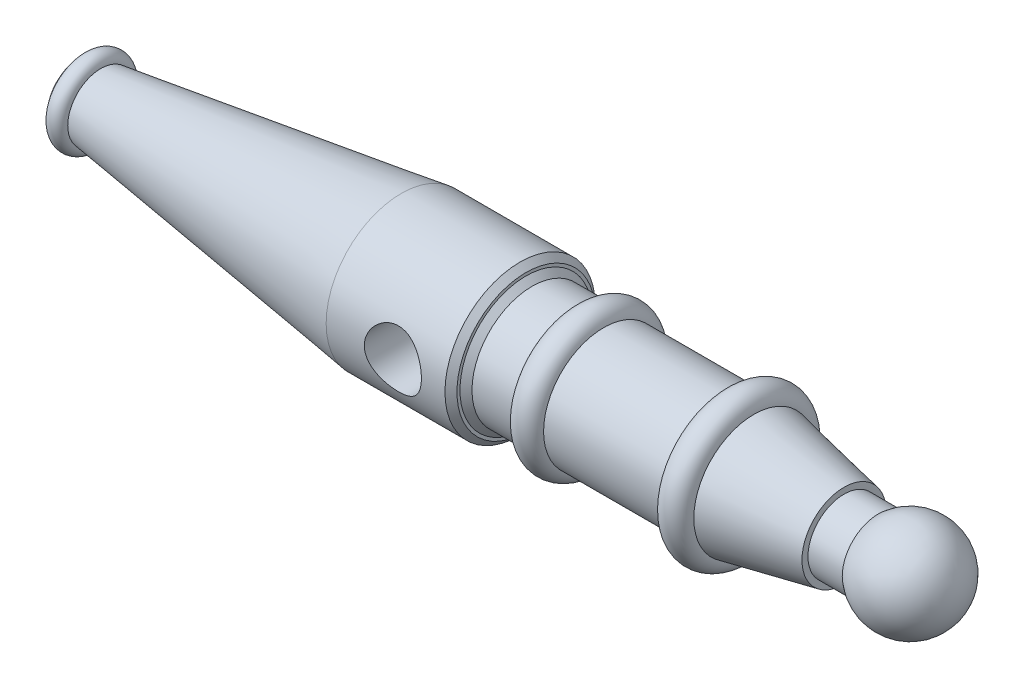
ISO-10303-21;
HEADER;
FILE_DESCRIPTION(('STEP AP214'),'2;1');
FILE_NAME('part.step','',(''),(''),'','','');
FILE_SCHEMA(('AUTOMOTIVE_DESIGN { 1 0 10303 214 1 1 1 1 }'));
ENDSEC;
DATA;
#1=APPLICATION_CONTEXT('core data for automotive mechanical design processes');
#2=APPLICATION_PROTOCOL_DEFINITION('international standard','automotive_design',2000,#1);
#3=PRODUCT_CONTEXT('',#1,'mechanical');
#4=PRODUCT('Part','Part','',(#3));
#5=PRODUCT_RELATED_PRODUCT_CATEGORY('part','',(#4));
#6=PRODUCT_DEFINITION_FORMATION('','',#4);
#7=PRODUCT_DEFINITION_CONTEXT('part definition',#1,'design');
#8=PRODUCT_DEFINITION('design','',#6,#7);
#9=PRODUCT_DEFINITION_SHAPE('','',#8);
#10=(LENGTH_UNIT() NAMED_UNIT(*) SI_UNIT(.MILLI.,.METRE.));
#11=(NAMED_UNIT(*) PLANE_ANGLE_UNIT() SI_UNIT($,.RADIAN.));
#12=(NAMED_UNIT(*) SI_UNIT($,.STERADIAN.) SOLID_ANGLE_UNIT());
#13=UNCERTAINTY_MEASURE_WITH_UNIT(LENGTH_MEASURE(1.E-05),#10,'distance_accuracy_value','');
#14=(GEOMETRIC_REPRESENTATION_CONTEXT(3) GLOBAL_UNCERTAINTY_ASSIGNED_CONTEXT((#13)) GLOBAL_UNIT_ASSIGNED_CONTEXT((#10,
#11,#12)) REPRESENTATION_CONTEXT('',''));
#15=CARTESIAN_POINT('',(0.,0.,0.));
#16=DIRECTION('',(0.,0.,1.));
#17=DIRECTION('',(1.,0.,0.));
#18=AXIS2_PLACEMENT_3D('',#15,#16,#17);
#19=CARTESIAN_POINT('',(19.,0.,0.));
#20=DIRECTION('',(-1.,0.,0.));
#21=DIRECTION('',(0.,0.,1.));
#22=AXIS2_PLACEMENT_3D('',#19,#20,#21);
#23=TOROIDAL_SURFACE('',#22,54.9999999999999,15.);
#24=CARTESIAN_POINT('',(34.,0.,0.));
#25=DIRECTION('',(-1.,0.,0.));
#26=DIRECTION('',(0.,0.,1.));
#27=AXIS2_PLACEMENT_3D('',#24,#25,#26);
#28=CIRCLE('',#27,54.9999999999998);
#29=CARTESIAN_POINT('',(34.,0.,54.9999999999998));
#30=VERTEX_POINT('',#29);
#31=EDGE_CURVE('E207',#30,#30,#28,.T.);
#32=ORIENTED_EDGE('',*,*,#31,.T.);
#33=EDGE_LOOP('',(#32));
#34=FACE_BOUND('',#33,.T.);
#35=CARTESIAN_POINT('',(4.,0.,0.));
#36=DIRECTION('',(-1.,0.,0.));
#37=DIRECTION('',(0.,0.,1.));
#38=AXIS2_PLACEMENT_3D('',#35,#36,#37);
#39=CIRCLE('',#38,55.);
#40=CARTESIAN_POINT('',(4.,0.,55.));
#41=VERTEX_POINT('',#40);
#42=EDGE_CURVE('E165',#41,#41,#39,.T.);
#43=ORIENTED_EDGE('',*,*,#42,.F.);
#44=EDGE_LOOP('',(#43));
#45=FACE_BOUND('',#44,.T.);
#46=ADVANCED_FACE('F42',(#34,#45),#23,.T.);
#47=CARTESIAN_POINT('',(0.,0.,0.));
#48=DIRECTION('',(-1.,0.,0.));
#49=DIRECTION('',(0.,0.,1.));
#50=AXIS2_PLACEMENT_3D('',#47,#48,#49);
#51=CYLINDRICAL_SURFACE('',#50,55.);
#52=ORIENTED_EDGE('',*,*,#42,.T.);
#53=EDGE_LOOP('',(#52));
#54=FACE_BOUND('',#53,.T.);
#55=CARTESIAN_POINT('',(0.,0.,0.));
#56=DIRECTION('',(-1.,0.,0.));
#57=DIRECTION('',(0.,0.,1.));
#58=AXIS2_PLACEMENT_3D('',#55,#56,#57);
#59=CIRCLE('',#58,55.);
#60=CARTESIAN_POINT('',(0.,0.,55.));
#61=VERTEX_POINT('',#60);
#62=EDGE_CURVE('E171',#61,#61,#59,.T.);
#63=ORIENTED_EDGE('',*,*,#62,.F.);
#64=EDGE_LOOP('',(#63));
#65=FACE_BOUND('',#64,.T.);
#66=ADVANCED_FACE('F97',(#54,#65),#51,.T.);
#67=CARTESIAN_POINT('',(0.,0.,0.));
#68=DIRECTION('',(1.,0.,0.));
#69=DIRECTION('',(0.,0.,-1.));
#70=AXIS2_PLACEMENT_3D('',#67,#68,#69);
#71=PLANE('',#70);
#72=CARTESIAN_POINT('',(0.,0.,0.));
#73=DIRECTION('',(-1.,0.,0.));
#74=DIRECTION('',(0.,0.,1.));
#75=AXIS2_PLACEMENT_3D('',#72,#73,#74);
#76=CIRCLE('',#75,47.5);
#77=CARTESIAN_POINT('',(0.,0.,47.5));
#78=VERTEX_POINT('',#77);
#79=EDGE_CURVE('E210',#78,#78,#76,.T.);
#80=ORIENTED_EDGE('',*,*,#79,.F.);
#81=EDGE_LOOP('',(#80));
#82=FACE_BOUND('',#81,.T.);
#83=ORIENTED_EDGE('',*,*,#62,.T.);
#84=EDGE_LOOP('',(#83));
#85=FACE_BOUND('',#84,.T.);
#86=ADVANCED_FACE('F103',(#82,#85),#71,.F.);
#87=CARTESIAN_POINT('',(1380.76376416123,0.,0.));
#88=DIRECTION('',(-1.,0.,0.));
#89=DIRECTION('',(0.,1.,0.));
#90=AXIS2_PLACEMENT_3D('',#87,#88,#89);
#91=SPHERICAL_SURFACE('',#90,80.);
#92=CARTESIAN_POINT('',(1327.84873793994,0.,0.));
#93=DIRECTION('',(-1.,0.,0.));
#94=DIRECTION('',(0.,0.,1.));
#95=AXIS2_PLACEMENT_3D('',#92,#93,#94);
#96=CIRCLE('',#95,60.);
#97=CARTESIAN_POINT('',(1327.84873793994,0.,60.));
#98=VERTEX_POINT('',#97);
#99=EDGE_CURVE('E175',#98,#98,#96,.T.);
#100=ORIENTED_EDGE('',*,*,#99,.F.);
#101=EDGE_LOOP('',(#100));
#102=FACE_BOUND('',#101,.T.);
#103=ADVANCED_FACE('F116',(#102),#91,.T.);
#104=CARTESIAN_POINT('',(0.,0.,0.));
#105=DIRECTION('',(-1.,0.,0.));
#106=DIRECTION('',(0.,0.,1.));
#107=AXIS2_PLACEMENT_3D('',#104,#105,#106);
#108=CYLINDRICAL_SURFACE('',#107,60.);
#109=ORIENTED_EDGE('',*,*,#99,.T.);
#110=EDGE_LOOP('',(#109));
#111=FACE_BOUND('',#110,.T.);
#112=CARTESIAN_POINT('',(1270.84873793994,0.,0.));
#113=DIRECTION('',(-1.,0.,0.));
#114=DIRECTION('',(0.,0.,1.));
#115=AXIS2_PLACEMENT_3D('',#112,#113,#114);
#116=CIRCLE('',#115,60.);
#117=CARTESIAN_POINT('',(1270.84873793994,0.,60.));
#118=VERTEX_POINT('',#117);
#119=EDGE_CURVE('E179',#118,#118,#116,.T.);
#120=ORIENTED_EDGE('',*,*,#119,.F.);
#121=EDGE_LOOP('',(#120));
#122=FACE_BOUND('',#121,.T.);
#123=ADVANCED_FACE('F120',(#111,#122),#108,.T.);
#124=CARTESIAN_POINT('',(1270.84873793994,0.,0.));
#125=DIRECTION('',(-1.,0.,0.));
#126=DIRECTION('',(0.,0.,1.));
#127=AXIS2_PLACEMENT_3D('',#124,#125,#126);
#128=PLANE('',#127);
#129=CARTESIAN_POINT('',(1270.84873793994,0.,0.));
#130=DIRECTION('',(-1.,0.,0.));
#131=DIRECTION('',(0.,0.,1.));
#132=AXIS2_PLACEMENT_3D('',#129,#130,#131);
#133=CIRCLE('',#132,70.);
#134=CARTESIAN_POINT('',(1270.84873793994,0.,70.));
#135=VERTEX_POINT('',#134);
#136=EDGE_CURVE('E183',#135,#135,#133,.T.);
#137=ORIENTED_EDGE('',*,*,#136,.F.);
#138=EDGE_LOOP('',(#137));
#139=FACE_BOUND('',#138,.T.);
#140=ORIENTED_EDGE('',*,*,#119,.T.);
#141=EDGE_LOOP('',(#140));
#142=FACE_BOUND('',#141,.T.);
#143=ADVANCED_FACE('F124',(#139,#142),#128,.F.);
#144=CARTESIAN_POINT('',(1270.84873793994,0.,0.));
#145=DIRECTION('',(-1.,0.,0.));
#146=DIRECTION('',(0.,0.,1.));
#147=AXIS2_PLACEMENT_3D('',#144,#145,#146);
#148=CONICAL_SURFACE('',#147,70.,0.197395559849881);
#149=CARTESIAN_POINT('',(1120.84873793994,0.,0.));
#150=DIRECTION('',(-1.,0.,0.));
#151=DIRECTION('',(0.,0.,1.));
#152=AXIS2_PLACEMENT_3D('',#149,#150,#151);
#153=CIRCLE('',#152,100.);
#154=CARTESIAN_POINT('',(1120.84873793994,0.,100.));
#155=VERTEX_POINT('',#154);
#156=EDGE_CURVE('E187',#155,#155,#153,.T.);
#157=ORIENTED_EDGE('',*,*,#156,.F.);
#158=EDGE_LOOP('',(#157));
#159=FACE_BOUND('',#158,.T.);
#160=ORIENTED_EDGE('',*,*,#136,.T.);
#161=EDGE_LOOP('',(#160));
#162=FACE_BOUND('',#161,.T.);
#163=ADVANCED_FACE('F128',(#159,#162),#148,.T.);
#164=CARTESIAN_POINT('',(1095.84873793994,0.,0.));
#165=DIRECTION('',(-1.,0.,0.));
#166=DIRECTION('',(0.,0.,1.));
#167=AXIS2_PLACEMENT_3D('',#164,#165,#166);
#168=TOROIDAL_SURFACE('',#167,100.,24.9999999999998);
#169=CARTESIAN_POINT('',(1070.84873793994,0.,0.));
#170=DIRECTION('',(-1.,0.,0.));
#171=DIRECTION('',(0.,0.,1.));
#172=AXIS2_PLACEMENT_3D('',#169,#170,#171);
#173=CIRCLE('',#172,100.);
#174=CARTESIAN_POINT('',(1070.84873793994,0.,100.));
#175=VERTEX_POINT('',#174);
#176=EDGE_CURVE('E191',#175,#175,#173,.T.);
#177=ORIENTED_EDGE('',*,*,#176,.F.);
#178=EDGE_LOOP('',(#177));
#179=FACE_BOUND('',#178,.T.);
#180=ORIENTED_EDGE('',*,*,#156,.T.);
#181=EDGE_LOOP('',(#180));
#182=FACE_BOUND('',#181,.T.);
#183=ADVANCED_FACE('F132',(#179,#182),#168,.T.);
#184=CARTESIAN_POINT('',(0.,0.,0.));
#185=DIRECTION('',(-1.,0.,0.));
#186=DIRECTION('',(0.,0.,1.));
#187=AXIS2_PLACEMENT_3D('',#184,#185,#186);
#188=CYLINDRICAL_SURFACE('',#187,100.);
#189=CARTESIAN_POINT('',(870.848737939936,0.,0.));
#190=DIRECTION('',(-1.,0.,0.));
#191=DIRECTION('',(0.,0.,1.));
#192=AXIS2_PLACEMENT_3D('',#189,#190,#191);
#193=CIRCLE('',#192,100.);
#194=CARTESIAN_POINT('',(870.848737939936,0.,100.));
#195=VERTEX_POINT('',#194);
#196=EDGE_CURVE('E195',#195,#195,#193,.T.);
#197=ORIENTED_EDGE('',*,*,#196,.F.);
#198=EDGE_LOOP('',(#197));
#199=FACE_BOUND('',#198,.T.);
#200=ORIENTED_EDGE('',*,*,#176,.T.);
#201=EDGE_LOOP('',(#200));
#202=FACE_BOUND('',#201,.T.);
#203=ADVANCED_FACE('F136',(#199,#202),#188,.T.);
#204=CARTESIAN_POINT('',(846.281702676516,0.,0.));
#205=DIRECTION('',(-1.,0.,0.));
#206=DIRECTION('',(0.,0.,1.));
#207=AXIS2_PLACEMENT_3D('',#204,#205,#206);
#208=TOROIDAL_SURFACE('',#207,95.3674220604617,25.);
#209=CARTESIAN_POINT('',(821.714667413097,0.,0.));
#210=DIRECTION('',(-1.,0.,0.));
#211=DIRECTION('',(0.,0.,1.));
#212=AXIS2_PLACEMENT_3D('',#209,#210,#211);
#213=CIRCLE('',#212,100.);
#214=CARTESIAN_POINT('',(821.714667413097,0.,100.));
#215=VERTEX_POINT('',#214);
#216=EDGE_CURVE('E199',#215,#215,#213,.T.);
#217=ORIENTED_EDGE('',*,*,#216,.F.);
#218=EDGE_LOOP('',(#217));
#219=FACE_BOUND('',#218,.T.);
#220=ORIENTED_EDGE('',*,*,#196,.T.);
#221=EDGE_LOOP('',(#220));
#222=FACE_BOUND('',#221,.T.);
#223=ADVANCED_FACE('F140',(#219,#222),#208,.T.);
#224=CARTESIAN_POINT('',(0.,0.,0.));
#225=DIRECTION('',(-1.,0.,0.));
#226=DIRECTION('',(0.,0.,1.));
#227=AXIS2_PLACEMENT_3D('',#224,#225,#226);
#228=CYLINDRICAL_SURFACE('',#227,100.);
#229=CARTESIAN_POINT('',(751.714667413097,0.,0.));
#230=DIRECTION('',(1.,0.,0.));
#231=DIRECTION('',(0.,0.,-1.));
#232=AXIS2_PLACEMENT_3D('',#229,#230,#231);
#233=CIRCLE('',#232,100.);
#234=CARTESIAN_POINT('',(751.714667413097,0.,-100.));
#235=VERTEX_POINT('',#234);
#236=EDGE_CURVE('E61',#235,#235,#233,.T.);
#237=ORIENTED_EDGE('',*,*,#236,.T.);
#238=EDGE_LOOP('',(#237));
#239=FACE_BOUND('',#238,.T.);
#240=ORIENTED_EDGE('',*,*,#216,.T.);
#241=EDGE_LOOP('',(#240));
#242=FACE_BOUND('',#241,.T.);
#243=ADVANCED_FACE('F144',(#239,#242),#228,.T.);
#244=CARTESIAN_POINT('',(741.714667413097,0.,0.));
#245=DIRECTION('',(1.,0.,0.));
#246=DIRECTION('',(0.,0.,-1.));
#247=AXIS2_PLACEMENT_3D('',#244,#245,#246);
#248=PLANE('',#247);
#249=CARTESIAN_POINT('',(741.714667413097,0.,0.));
#250=DIRECTION('',(1.,0.,0.));
#251=DIRECTION('',(0.,0.,-1.));
#252=AXIS2_PLACEMENT_3D('',#249,#250,#251);
#253=CIRCLE('',#252,115.);
#254=CARTESIAN_POINT('',(741.714667413097,0.,-115.));
#255=VERTEX_POINT('',#254);
#256=EDGE_CURVE('E66',#255,#255,#253,.T.);
#257=ORIENTED_EDGE('',*,*,#256,.T.);
#258=EDGE_LOOP('',(#257));
#259=FACE_BOUND('',#258,.T.);
#260=CARTESIAN_POINT('',(741.714667413097,0.,0.));
#261=DIRECTION('',(1.,0.,0.));
#262=DIRECTION('',(0.,0.,-1.));
#263=AXIS2_PLACEMENT_3D('',#260,#261,#262);
#264=CIRCLE('',#263,110.000000000001);
#265=CARTESIAN_POINT('',(741.714667413097,0.,-110.000000000001));
#266=VERTEX_POINT('',#265);
#267=EDGE_CURVE('E157',#266,#266,#264,.F.);
#268=ORIENTED_EDGE('',*,*,#267,.T.);
#269=EDGE_LOOP('',(#268));
#270=FACE_BOUND('',#269,.T.);
#271=ADVANCED_FACE('F93',(#259,#270),#248,.T.);
#272=CARTESIAN_POINT('',(0.,0.,0.));
#273=DIRECTION('',(-1.,0.,0.));
#274=DIRECTION('',(0.,0.,1.));
#275=AXIS2_PLACEMENT_3D('',#272,#273,#274);
#276=CYLINDRICAL_SURFACE('',#275,124.999999999999);
#277=CARTESIAN_POINT('',(692.5,0.,-124.999999999999));
#278=CARTESIAN_POINT('',(692.50000676516,1.2849271674247,-125.000005018426));
#279=CARTESIAN_POINT('',(692.447822691497,2.56976198111384,-124.980145337505));
#280=CARTESIAN_POINT('',(692.239654632818,5.12969501400117,-124.901263258785));
#281=CARTESIAN_POINT('',(692.08368048332,6.40479414420784,-124.842244571836));
#282=CARTESIAN_POINT('',(691.669556549392,8.93569300325948,-124.686650456919));
#283=CARTESIAN_POINT('',(691.411424610546,10.1914960630861,-124.590081588513));
#284=CARTESIAN_POINT('',(690.795491950269,12.675172656922,-124.36195287126));
#285=CARTESIAN_POINT('',(690.437688333565,13.903045378487,-124.230392005968));
#286=CARTESIAN_POINT('',(689.626519387184,16.3200996223809,-123.936006830322));
#287=CARTESIAN_POINT('',(689.173348650251,17.5093543248301,-123.773246241103));
#288=CARTESIAN_POINT('',(688.174843198296,19.8442717480155,-123.420415933334));
#289=CARTESIAN_POINT('',(687.629509248233,20.9899348304681,-123.230346441452));
#290=CARTESIAN_POINT('',(686.450804859467,23.2311097043018,-122.827571985207));
#291=CARTESIAN_POINT('',(685.817415643136,24.3266107322994,-122.614862195116));
#292=CARTESIAN_POINT('',(684.467023460525,26.4612700837835,-122.171965804673));
#293=CARTESIAN_POINT('',(683.750017858507,27.5004266296773,-121.941778653483));
#294=CARTESIAN_POINT('',(682.600684812765,29.0321832433588,-121.582984872137));
#295=CARTESIAN_POINT('',(682.197030800232,29.5475736866143,-121.45869046257));
#296=CARTESIAN_POINT('',(681.369079841315,30.5608896533286,-121.207690882118));
#297=CARTESIAN_POINT('',(680.944784056161,31.0588161565374,-121.080985847089));
#298=CARTESIAN_POINT('',(680.076239460578,32.0364627368623,-120.825991690483));
#299=CARTESIAN_POINT('',(679.63199207287,32.5161841076751,-120.697702682329));
#300=CARTESIAN_POINT('',(678.72410491077,33.4568710377908,-120.440340759223));
#301=CARTESIAN_POINT('',(678.260460516756,33.9178320769395,-120.311267663862));
#302=CARTESIAN_POINT('',(676.841419214522,35.2715616891124,-119.924132914316));
#303=CARTESIAN_POINT('',(675.857900287768,36.1351923969078,-119.666151675129));
#304=CARTESIAN_POINT('',(673.821805533593,37.7791682718835,-119.15735488785));
#305=CARTESIAN_POINT('',(672.7692298913,38.5595136623206,-118.906539320551));
#306=CARTESIAN_POINT('',(671.121814515758,39.6782688638012,-118.536059921928));
#307=CARTESIAN_POINT('',(670.549831874832,40.0489845490804,-118.411242450313));
#308=CARTESIAN_POINT('',(669.389809228658,40.7658176007834,-118.166372199717));
#309=CARTESIAN_POINT('',(668.801773051613,41.1119407619481,-118.046318301257));
#310=CARTESIAN_POINT('',(667.610382930647,41.7790224190779,-117.81187685623));
#311=CARTESIAN_POINT('',(667.007027024307,42.0999776693477,-117.697490041197));
#312=CARTESIAN_POINT('',(665.786062294117,42.7160084807204,-117.47531555797));
#313=CARTESIAN_POINT('',(665.168452602026,43.0110824600339,-117.367528293242));
#314=CARTESIAN_POINT('',(663.296224521746,43.8562632384637,-117.055497433889));
#315=CARTESIAN_POINT('',(662.021500556523,44.3667247685352,-116.862444057089));
#316=CARTESIAN_POINT('',(659.428321977462,45.2765051071035,-116.512985964022));
#317=CARTESIAN_POINT('',(658.10987001219,45.6758306332991,-116.356579032725));
#318=CARTESIAN_POINT('',(655.495044738942,46.3448808978937,-116.091670866419));
#319=CARTESIAN_POINT('',(654.200058414119,46.6193320111835,-115.981437999672));
#320=CARTESIAN_POINT('',(651.588829665791,47.0594329956567,-115.803567958241));
#321=CARTESIAN_POINT('',(650.272587802047,47.2250857272533,-115.735929663707));
#322=CARTESIAN_POINT('',(647.629797864523,47.4456716428059,-115.645676560576));
#323=CARTESIAN_POINT('',(646.303253761316,47.5006455455632,-115.623045193944));
#324=CARTESIAN_POINT('',(643.650257922267,47.4993430799609,-115.623581076582));
#325=CARTESIAN_POINT('',(642.323806184856,47.4430711901906,-115.646746482143));
#326=CARTESIAN_POINT('',(639.76356307951,47.2268656895172,-115.73519568773));
#327=CARTESIAN_POINT('',(638.529112272486,47.0735547380743,-115.797787507411));
#328=CARTESIAN_POINT('',(636.078504880489,46.6711760487632,-115.960546646452));
#329=CARTESIAN_POINT('',(634.862347430711,46.4221128523854,-116.0607121837));
#330=CARTESIAN_POINT('',(632.456275214542,45.8305571432365,-116.295576473683));
#331=CARTESIAN_POINT('',(631.266363322182,45.4880544526927,-116.430278988217));
#332=CARTESIAN_POINT('',(628.920375446783,44.7126631430792,-116.730246284058));
#333=CARTESIAN_POINT('',(627.764300595583,44.2797715044572,-116.895512086348));
#334=CARTESIAN_POINT('',(625.47079898711,43.3178462774495,-117.2554166901));
#335=CARTESIAN_POINT('',(624.334155431206,42.7871276287037,-117.450558157761));
#336=CARTESIAN_POINT('',(622.665916885136,41.9264903414215,-117.759339915788));
#337=CARTESIAN_POINT('',(622.11593275234,41.6288353793677,-117.864950932365));
#338=CARTESIAN_POINT('',(621.028707812863,41.0124091189826,-118.080857904717));
#339=CARTESIAN_POINT('',(620.491469682207,40.6936334387113,-118.19115483097));
#340=CARTESIAN_POINT('',(618.899998485348,39.7064033697926,-118.527993127994));
#341=CARTESIAN_POINT('',(617.86599132771,39.0070370266403,-118.760485252721));
#342=CARTESIAN_POINT('',(615.857628994384,37.5303335210958,-119.235377967013));
#343=CARTESIAN_POINT('',(614.883276592296,36.7529927377712,-119.477779016414));
#344=CARTESIAN_POINT('',(613.437683688311,35.5037111963704,-119.85279769498));
#345=CARTESIAN_POINT('',(612.943263894542,35.057931498026,-119.984026085245));
#346=CARTESIAN_POINT('',(611.973737644043,34.1461385504411,-120.246689454446));
#347=CARTESIAN_POINT('',(611.498626827612,33.6801299183125,-120.378124379711));
#348=CARTESIAN_POINT('',(610.103056953906,32.2525069261578,-120.77147728379));
#349=CARTESIAN_POINT('',(609.212305340598,31.2612478153622,-121.032457847301));
#350=CARTESIAN_POINT('',(607.516073952146,29.2058473618003,-121.544809020291));
#351=CARTESIAN_POINT('',(606.710608728384,28.1416936327567,-121.7961779852));
#352=CARTESIAN_POINT('',(605.190497372134,25.9467780750064,-122.282574118138));
#353=CARTESIAN_POINT('',(604.475850693068,24.8160166472286,-122.517601384514));
#354=CARTESIAN_POINT('',(603.131896189838,22.4758124854458,-122.968616684437));
#355=CARTESIAN_POINT('',(602.504173854403,21.2653859134339,-123.184230805613));
#356=CARTESIAN_POINT('',(601.353536718459,18.7908991395602,-123.585893050066));
#357=CARTESIAN_POINT('',(600.830623923062,17.5268379121741,-123.771940607692));
#358=CARTESIAN_POINT('',(599.894764903049,14.9545998648748,-124.108990890306));
#359=CARTESIAN_POINT('',(599.48177806092,13.6464395413847,-124.26000655688));
#360=CARTESIAN_POINT('',(598.769814623,10.9955927409216,-124.522569692076));
#361=CARTESIAN_POINT('',(598.470830996985,9.65290839838955,-124.634119594397));
#362=CARTESIAN_POINT('',(598.003236646832,7.01759107866686,-124.809460917357));
#363=CARTESIAN_POINT('',(597.828419910445,5.72620734774753,-124.875519746648));
#364=CARTESIAN_POINT('',(597.585473235344,3.13203120051061,-124.967494183786));
#365=CARTESIAN_POINT('',(597.517339427529,1.82923919966333,-124.993411247466));
#366=CARTESIAN_POINT('',(597.488483318778,-0.777436967492819,-125.004376166944));
#367=CARTESIAN_POINT('',(597.527739475051,-2.08132086230679,-124.989432219599));
#368=CARTESIAN_POINT('',(597.713198201032,-4.68034368826085,-124.919110836671));
#369=CARTESIAN_POINT('',(597.85939906446,-5.97548275858993,-124.863734046184));
#370=CARTESIAN_POINT('',(598.249286070419,-8.49599436937247,-124.717072380084));
#371=CARTESIAN_POINT('',(598.48886591097,-9.72209365092606,-124.627302444089));
#372=CARTESIAN_POINT('',(599.062968714554,-12.1488166843962,-124.414186631736));
#373=CARTESIAN_POINT('',(599.397488508601,-13.3494412851912,-124.290841876073));
#374=CARTESIAN_POINT('',(600.158566968472,-15.7176001750415,-124.013622645739));
#375=CARTESIAN_POINT('',(600.585133170823,-16.8851317456629,-123.859745671252));
#376=CARTESIAN_POINT('',(601.526810991555,-19.1799433421884,-123.52519800747));
#377=CARTESIAN_POINT('',(602.041925542823,-20.3072220333483,-123.344526430716));
#378=CARTESIAN_POINT('',(603.173362113986,-22.5478114705223,-122.954980691788));
#379=CARTESIAN_POINT('',(603.79223134561,-23.6597178981112,-122.745429338789));
#380=CARTESIAN_POINT('',(605.115241905845,-25.8276755020338,-122.307621844967));
#381=CARTESIAN_POINT('',(605.819384412791,-26.8837259062404,-122.079365445684));
#382=CARTESIAN_POINT('',(607.308527049079,-28.9345686216089,-121.609612549462));
#383=CARTESIAN_POINT('',(608.093552809141,-29.9293413542206,-121.368111867012));
#384=CARTESIAN_POINT('',(609.739535354384,-31.852021822686,-120.877761501386));
#385=CARTESIAN_POINT('',(610.600494865206,-32.7799271561604,-120.628911554621));
#386=CARTESIAN_POINT('',(612.447023691486,-34.617186330973,-120.115002492798));
#387=CARTESIAN_POINT('',(613.436962662356,-35.522131502835,-119.849861988682));
#388=CARTESIAN_POINT('',(615.490748936808,-37.2458256589097,-119.325438597588));
#389=CARTESIAN_POINT('',(616.554599327037,-38.0645710396986,-119.066155955842));
#390=CARTESIAN_POINT('',(618.750071711411,-39.6105278647695,-118.560818545709));
#391=CARTESIAN_POINT('',(619.88170243499,-40.337727481298,-118.314765488938));
#392=CARTESIAN_POINT('',(622.205814011851,-41.6951556800968,-117.843245343279));
#393=CARTESIAN_POINT('',(623.398293970464,-42.3253856875694,-117.617777951854));
#394=CARTESIAN_POINT('',(625.843001218186,-43.4867814583011,-117.193363144825));
#395=CARTESIAN_POINT('',(627.095508029961,-44.0174126323949,-116.994560389401));
#396=CARTESIAN_POINT('',(629.645923568803,-44.9706069427029,-116.631492036611));
#397=CARTESIAN_POINT('',(630.943832739758,-45.393169022016,-116.467226777019));
#398=CARTESIAN_POINT('',(633.574728803385,-46.1256612524397,-116.179079243406));
#399=CARTESIAN_POINT('',(634.907696468056,-46.4356518172898,-116.055175312364));
#400=CARTESIAN_POINT('',(637.598702823087,-46.9397942822767,-115.852189956564));
#401=CARTESIAN_POINT('',(638.956739691146,-47.1339545682926,-115.773105287003));
#402=CARTESIAN_POINT('',(641.596525552806,-47.3952330620122,-115.666374526036));
#403=CARTESIAN_POINT('',(642.877412317198,-47.4698721344356,-115.635685319125));
#404=CARTESIAN_POINT('',(645.441307673321,-47.5152493191255,-115.617048075675));
#405=CARTESIAN_POINT('',(646.724316165095,-47.4859921941345,-115.629098079913));
#406=CARTESIAN_POINT('',(649.282522680886,-47.323911756205,-115.695526880221));
#407=CARTESIAN_POINT('',(650.557721440678,-47.1910983556803,-115.749901624961));
#408=CARTESIAN_POINT('',(653.090880971089,-46.8233454931559,-115.899152653242));
#409=CARTESIAN_POINT('',(654.348841765246,-46.5884061706243,-115.994028881472));
#410=CARTESIAN_POINT('',(656.798263691148,-46.028015788969,-116.217509380612));
#411=CARTESIAN_POINT('',(657.990560629281,-45.7057313238982,-116.344926023482));
#412=CARTESIAN_POINT('',(660.342994442419,-44.97066944828,-116.631017676819));
#413=CARTESIAN_POINT('',(661.503132256734,-44.5578946839375,-116.789691773212));
#414=CARTESIAN_POINT('',(663.784677470405,-43.6451125477975,-117.133863080081));
#415=CARTESIAN_POINT('',(664.906077452251,-43.1450885792478,-117.319365392735));
#416=CARTESIAN_POINT('',(667.103773042058,-42.0615570622635,-117.712180444248));
#417=CARTESIAN_POINT('',(668.180066611103,-41.4780457452528,-117.919494167552));
#418=CARTESIAN_POINT('',(670.338301812872,-40.1979736079069,-118.36217899485));
#419=CARTESIAN_POINT('',(671.41747360384,-39.4970387794351,-118.598457321594));
#420=CARTESIAN_POINT('',(672.989343132111,-38.3830616123653,-118.961729740651));
#421=CARTESIAN_POINT('',(673.505513414702,-38.0012828712559,-119.084303705868));
#422=CARTESIAN_POINT('',(674.52176000005,-37.2173021995347,-119.331644711955));
#423=CARTESIAN_POINT('',(675.021832679355,-36.8150957225873,-119.456412236941));
#424=CARTESIAN_POINT('',(676.496807899419,-35.5787447995804,-119.832779324236));
#425=CARTESIAN_POINT('',(677.446495946238,-34.7148487784242,-120.086450014748));
#426=CARTESIAN_POINT('',(679.273001592866,-32.9128722250857,-120.592779151237));
#427=CARTESIAN_POINT('',(680.149817870015,-31.9747903469939,-120.845437578762));
#428=CARTESIAN_POINT('',(681.430082405842,-30.4886712099354,-121.225914795745));
#429=CARTESIAN_POINT('',(681.861729906168,-29.9653684322861,-121.356404984591));
#430=CARTESIAN_POINT('',(682.702477017174,-28.900402996907,-121.614418272242));
#431=CARTESIAN_POINT('',(683.111581806153,-28.3587446022162,-121.741942048541));
#432=CARTESIAN_POINT('',(683.906645161933,-27.2577342030109,-121.993175005414));
#433=CARTESIAN_POINT('',(684.292601026678,-26.6983801445659,-122.116883739862));
#434=CARTESIAN_POINT('',(685.040598036118,-25.5629203222706,-122.359610986203));
#435=CARTESIAN_POINT('',(685.402637716384,-24.9868135357268,-122.478629210709));
#436=CARTESIAN_POINT('',(686.451867761036,-23.2345756004221,-122.827405563256));
#437=CARTESIAN_POINT('',(687.102252132658,-22.0344119875895,-123.048911856224));
#438=CARTESIAN_POINT('',(688.298870252681,-19.5786664296437,-123.463464515982));
#439=CARTESIAN_POINT('',(688.845101392451,-18.3230830974522,-123.656510169915));
#440=CARTESIAN_POINT('',(689.855391399807,-15.6949730246123,-124.018229662135));
#441=CARTESIAN_POINT('',(690.313306452295,-14.3198084133663,-124.184988066275));
#442=CARTESIAN_POINT('',(691.102439791613,-11.5290085553779,-124.47509852045));
#443=CARTESIAN_POINT('',(691.433650275216,-10.1133708218264,-124.598447897059));
#444=CARTESIAN_POINT('',(691.96516003186,-7.25505552375621,-124.797497873604));
#445=CARTESIAN_POINT('',(692.165518324502,-5.81239045211944,-124.873219954795));
#446=CARTESIAN_POINT('',(692.432925906562,-2.9131094876674,-124.974464947439));
#447=CARTESIAN_POINT('',(692.499992331531,-1.45649541228429,-124.999994311492));
#448=CARTESIAN_POINT('',(692.5,0.,-124.999999999999));
#449=B_SPLINE_CURVE_WITH_KNOTS('',3,(#277,#278,#279,#280,#281,#282,#283,#284,#285,#286,#287,
#288,#289,#290,#291,#292,#293,#294,#295,#296,#297,#298,#299,#300,#301,#302,#303,#304,#305,#306,
#307,#308,#309,#310,#311,#312,#313,#314,#315,#316,#317,#318,#319,#320,#321,#322,#323,#324,#325,
#326,#327,#328,#329,#330,#331,#332,#333,#334,#335,#336,#337,#338,#339,#340,#341,#342,#343,#344,
#345,#346,#347,#348,#349,#350,#351,#352,#353,#354,#355,#356,#357,#358,#359,#360,#361,#362,#363,
#364,#365,#366,#367,#368,#369,#370,#371,#372,#373,#374,#375,#376,#377,#378,#379,#380,#381,#382,
#383,#384,#385,#386,#387,#388,#389,#390,#391,#392,#393,#394,#395,#396,#397,#398,#399,#400,#401,
#402,#403,#404,#405,#406,#407,#408,#409,#410,#411,#412,#413,#414,#415,#416,#417,#418,#419,#420,
#421,#422,#423,#424,#425,#426,#427,#428,#429,#430,#431,#432,#433,#434,#435,#436,#437,#438,#439,
#440,#441,#442,#443,#444,#445,#446,#447,#448),.UNSPECIFIED.,.T.,.F.,(4,2,2,2,2,2,2,2,2,2,2,2,2,
2,2,2,2,2,2,2,2,2,2,2,2,2,2,2,2,2,2,2,2,2,2,2,2,2,2,2,2,2,2,2,2,2,2,2,2,2,2,2,2,2,2,2,2,2,2,2,2,
2,2,2,2,2,2,2,2,2,2,2,2,2,2,2,2,2,2,2,2,2,2,2,2,4),(0.,3.85341559693593,7.70646608240168,
11.5588437889204,15.4113334113637,19.2560371088338,23.1007088965974,26.9462018149104,
30.7918159828522,32.7903845422601,34.7888407994012,36.7871547748898,38.7859474118673,
42.7834689004388,46.7809796728776,48.8592738372251,50.9370766574567,53.0151469953842,
55.0933442506731,59.2472811101834,63.4009668273131,67.3807357257907,71.3603999881615,
75.3385998621365,79.3166395829934,83.0487843313715,86.780752087456,90.5131265055734,
94.2456256281347,98.0497284747165,99.9519641755014,101.854595778687,105.659799985934,
109.465180978948,111.500225658398,113.53480827066,117.603751298161,121.67338744513,
125.74299909841,129.879117353634,134.015314729409,138.14998165673,142.284393570799,
146.193955734191,150.103376105084,154.01201229058,157.920586116019,161.673784974419,
165.426858570041,169.180239574412,172.933744921683,176.798502347812,180.663313184543,
184.529352512183,188.395530667825,192.49234047242,196.589321468678,200.686831254631,
204.784280812044,208.903130732374,213.022020932959,217.138697371092,221.25507573395,
225.100509595953,228.945767180335,232.790656741579,236.635541052075,240.356309994003,
244.076970144115,247.798338820197,251.519875529983,255.440221707914,257.40062132821,
259.361459177539,263.283029146499,267.204670278482,269.276517063338,271.3478859218,
273.419496091965,275.491232993035,279.63427565632,283.777422073051,288.147625182364,
292.518097391661,296.886596978294,301.254534929058),.UNSPECIFIED.);
#450=CARTESIAN_POINT('',(692.5,0.,-124.999999999999));
#451=VERTEX_POINT('',#450);
#452=EDGE_CURVE('E10',#451,#451,#449,.T.);
#453=ORIENTED_EDGE('',*,*,#452,.T.);
#454=EDGE_LOOP('',(#453));
#455=FACE_BOUND('',#454,.T.);
#456=CARTESIAN_POINT('',(692.5,0.,125.));
#457=CARTESIAN_POINT('',(692.50000676516,-1.28492716742469,125.000005018427));
#458=CARTESIAN_POINT('',(692.447822691497,-2.56976198111381,124.980145337505));
#459=CARTESIAN_POINT('',(692.239654632818,-5.12969501400112,124.901263258785));
#460=CARTESIAN_POINT('',(692.08368048332,-6.40479414420779,124.842244571835));
#461=CARTESIAN_POINT('',(691.669556549392,-8.93569300325945,124.686650456919));
#462=CARTESIAN_POINT('',(691.411424610546,-10.1914960630861,124.590081588513));
#463=CARTESIAN_POINT('',(690.795491950269,-12.6751726569219,124.36195287126));
#464=CARTESIAN_POINT('',(690.437688333565,-13.903045378487,124.230392005968));
#465=CARTESIAN_POINT('',(689.626519387184,-16.3200996223809,123.936006830322));
#466=CARTESIAN_POINT('',(689.173348650251,-17.50935432483,123.773246241103));
#467=CARTESIAN_POINT('',(688.174843198296,-19.8442717480153,123.420415933334));
#468=CARTESIAN_POINT('',(687.629509248233,-20.989934830468,123.230346441452));
#469=CARTESIAN_POINT('',(686.450804859467,-23.2311097043017,122.827571985207));
#470=CARTESIAN_POINT('',(685.817415643136,-24.3266107322993,122.614862195116));
#471=CARTESIAN_POINT('',(684.467023460525,-26.4612700837834,122.171965804673));
#472=CARTESIAN_POINT('',(683.750017858507,-27.5004266296772,121.941778653483));
#473=CARTESIAN_POINT('',(682.600684812765,-29.0321832433587,121.582984872137));
#474=CARTESIAN_POINT('',(682.197030800232,-29.5475736866143,121.45869046257));
#475=CARTESIAN_POINT('',(681.369079841315,-30.5608896533285,121.207690882118));
#476=CARTESIAN_POINT('',(680.944784056161,-31.0588161565373,121.080985847089));
#477=CARTESIAN_POINT('',(680.076239460578,-32.0364627368622,120.825991690483));
#478=CARTESIAN_POINT('',(679.63199207287,-32.5161841076751,120.697702682329));
#479=CARTESIAN_POINT('',(678.72410491077,-33.4568710377907,120.440340759223));
#480=CARTESIAN_POINT('',(678.260460516756,-33.9178320769395,120.311267663862));
#481=CARTESIAN_POINT('',(676.841419214522,-35.2715616891124,119.924132914316));
#482=CARTESIAN_POINT('',(675.857900287768,-36.1351923969077,119.666151675129));
#483=CARTESIAN_POINT('',(673.821805533593,-37.7791682718834,119.15735488785));
#484=CARTESIAN_POINT('',(672.7692298913,-38.5595136623205,118.906539320551));
#485=CARTESIAN_POINT('',(671.121814515758,-39.6782688638012,118.536059921928));
#486=CARTESIAN_POINT('',(670.549831874832,-40.0489845490804,118.411242450313));
#487=CARTESIAN_POINT('',(669.389809228658,-40.7658176007834,118.166372199717));
#488=CARTESIAN_POINT('',(668.801773051613,-41.1119407619481,118.046318301257));
#489=CARTESIAN_POINT('',(667.610382930647,-41.7790224190779,117.81187685623));
#490=CARTESIAN_POINT('',(667.007027024307,-42.0999776693477,117.697490041197));
#491=CARTESIAN_POINT('',(665.786062294117,-42.7160084807204,117.47531555797));
#492=CARTESIAN_POINT('',(665.168452602026,-43.0110824600339,117.367528293242));
#493=CARTESIAN_POINT('',(663.296224521746,-43.8562632384637,117.055497433889));
#494=CARTESIAN_POINT('',(662.021500556523,-44.3667247685352,116.862444057089));
#495=CARTESIAN_POINT('',(659.428321977462,-45.2765051071035,116.512985964022));
#496=CARTESIAN_POINT('',(658.10987001219,-45.6758306332991,116.356579032725));
#497=CARTESIAN_POINT('',(655.495044738943,-46.3448808978937,116.091670866419));
#498=CARTESIAN_POINT('',(654.200058414119,-46.6193320111835,115.981437999672));
#499=CARTESIAN_POINT('',(651.588829665792,-47.0594329956567,115.803567958241));
#500=CARTESIAN_POINT('',(650.272587802047,-47.2250857272533,115.735929663707));
#501=CARTESIAN_POINT('',(647.629797864523,-47.4456716428059,115.645676560576));
#502=CARTESIAN_POINT('',(646.303253761316,-47.5006455455632,115.623045193944));
#503=CARTESIAN_POINT('',(643.650257922267,-47.4993430799609,115.623581076582));
#504=CARTESIAN_POINT('',(642.323806184856,-47.4430711901906,115.646746482143));
#505=CARTESIAN_POINT('',(639.76356307951,-47.2268656895172,115.73519568773));
#506=CARTESIAN_POINT('',(638.529112272486,-47.0735547380743,115.797787507411));
#507=CARTESIAN_POINT('',(636.078504880489,-46.6711760487632,115.960546646452));
#508=CARTESIAN_POINT('',(634.862347430711,-46.4221128523854,116.0607121837));
#509=CARTESIAN_POINT('',(632.456275214542,-45.8305571432365,116.295576473683));
#510=CARTESIAN_POINT('',(631.266363322182,-45.4880544526927,116.430278988217));
#511=CARTESIAN_POINT('',(628.920375446783,-44.7126631430793,116.730246284058));
#512=CARTESIAN_POINT('',(627.764300595584,-44.2797715044572,116.895512086348));
#513=CARTESIAN_POINT('',(625.47079898711,-43.3178462774495,117.2554166901));
#514=CARTESIAN_POINT('',(624.334155431206,-42.7871276287037,117.450558157761));
#515=CARTESIAN_POINT('',(622.665916885136,-41.9264903414215,117.759339915788));
#516=CARTESIAN_POINT('',(622.11593275234,-41.6288353793678,117.864950932365));
#517=CARTESIAN_POINT('',(621.028707812863,-41.0124091189826,118.080857904717));
#518=CARTESIAN_POINT('',(620.491469682207,-40.6936334387114,118.19115483097));
#519=CARTESIAN_POINT('',(618.899998485348,-39.7064033697927,118.527993127994));
#520=CARTESIAN_POINT('',(617.865991327709,-39.0070370266404,118.760485252721));
#521=CARTESIAN_POINT('',(615.857628994384,-37.5303335210958,119.235377967013));
#522=CARTESIAN_POINT('',(614.883276592296,-36.7529927377711,119.477779016414));
#523=CARTESIAN_POINT('',(613.437683688312,-35.5037111963704,119.85279769498));
#524=CARTESIAN_POINT('',(612.943263894542,-35.057931498026,119.984026085245));
#525=CARTESIAN_POINT('',(611.973737644043,-34.1461385504412,120.246689454446));
#526=CARTESIAN_POINT('',(611.498626827612,-33.6801299183126,120.378124379711));
#527=CARTESIAN_POINT('',(610.103056953906,-32.2525069261579,120.77147728379));
#528=CARTESIAN_POINT('',(609.212305340598,-31.2612478153622,121.032457847301));
#529=CARTESIAN_POINT('',(607.516073952146,-29.2058473618004,121.544809020291));
#530=CARTESIAN_POINT('',(606.710608728384,-28.1416936327567,121.7961779852));
#531=CARTESIAN_POINT('',(605.190497372134,-25.9467780750064,122.282574118138));
#532=CARTESIAN_POINT('',(604.475850693068,-24.8160166472286,122.517601384514));
#533=CARTESIAN_POINT('',(603.131896189838,-22.4758124854458,122.968616684437));
#534=CARTESIAN_POINT('',(602.504173854403,-21.2653859134339,123.184230805613));
#535=CARTESIAN_POINT('',(601.353536718459,-18.7908991395602,123.585893050066));
#536=CARTESIAN_POINT('',(600.830623923062,-17.526837912174,123.771940607692));
#537=CARTESIAN_POINT('',(599.894764903049,-14.9545998648748,124.108990890306));
#538=CARTESIAN_POINT('',(599.48177806092,-13.6464395413847,124.26000655688));
#539=CARTESIAN_POINT('',(598.769814623,-10.9955927409217,124.522569692076));
#540=CARTESIAN_POINT('',(598.470830996985,-9.65290839838958,124.634119594397));
#541=CARTESIAN_POINT('',(598.003236646832,-7.01759107866691,124.809460917357));
#542=CARTESIAN_POINT('',(597.828419910445,-5.72620734774759,124.875519746648));
#543=CARTESIAN_POINT('',(597.585473235344,-3.13203120051067,124.967494183786));
#544=CARTESIAN_POINT('',(597.517339427529,-1.8292391996634,124.993411247466));
#545=CARTESIAN_POINT('',(597.488483318778,0.777436967492746,125.004376166944));
#546=CARTESIAN_POINT('',(597.527739475051,2.08132086230672,124.989432219599));
#547=CARTESIAN_POINT('',(597.713198201032,4.68034368826077,124.919110836671));
#548=CARTESIAN_POINT('',(597.85939906446,5.97548275858986,124.863734046184));
#549=CARTESIAN_POINT('',(598.249286070419,8.4959943693724,124.717072380084));
#550=CARTESIAN_POINT('',(598.48886591097,9.72209365092599,124.627302444089));
#551=CARTESIAN_POINT('',(599.062968714554,12.1488166843961,124.414186631736));
#552=CARTESIAN_POINT('',(599.397488508601,13.3494412851912,124.290841876073));
#553=CARTESIAN_POINT('',(600.158566968472,15.7176001750415,124.013622645739));
#554=CARTESIAN_POINT('',(600.585133170823,16.8851317456629,123.859745671252));
#555=CARTESIAN_POINT('',(601.526810991555,19.1799433421883,123.52519800747));
#556=CARTESIAN_POINT('',(602.041925542823,20.3072220333482,123.344526430716));
#557=CARTESIAN_POINT('',(603.173362113986,22.5478114705222,122.954980691788));
#558=CARTESIAN_POINT('',(603.79223134561,23.6597178981112,122.745429338789));
#559=CARTESIAN_POINT('',(605.115241905845,25.8276755020338,122.307621844967));
#560=CARTESIAN_POINT('',(605.819384412791,26.8837259062404,122.079365445684));
#561=CARTESIAN_POINT('',(607.308527049079,28.9345686216089,121.609612549462));
#562=CARTESIAN_POINT('',(608.093552809141,29.9293413542205,121.368111867012));
#563=CARTESIAN_POINT('',(609.739535354384,31.852021822686,120.877761501386));
#564=CARTESIAN_POINT('',(610.600494865206,32.7799271561604,120.628911554621));
#565=CARTESIAN_POINT('',(612.447023691486,34.617186330973,120.115002492798));
#566=CARTESIAN_POINT('',(613.436962662356,35.522131502835,119.849861988682));
#567=CARTESIAN_POINT('',(615.490748936808,37.2458256589097,119.325438597588));
#568=CARTESIAN_POINT('',(616.554599327037,38.0645710396985,119.066155955842));
#569=CARTESIAN_POINT('',(618.750071711411,39.6105278647694,118.560818545709));
#570=CARTESIAN_POINT('',(619.881702434989,40.3377274812979,118.314765488938));
#571=CARTESIAN_POINT('',(622.20581401185,41.6951556800967,117.843245343279));
#572=CARTESIAN_POINT('',(623.398293970464,42.3253856875693,117.617777951854));
#573=CARTESIAN_POINT('',(625.843001218186,43.4867814583011,117.193363144825));
#574=CARTESIAN_POINT('',(627.09550802996,44.0174126323948,116.994560389401));
#575=CARTESIAN_POINT('',(629.645923568802,44.9706069427028,116.631492036611));
#576=CARTESIAN_POINT('',(630.943832739757,45.393169022016,116.467226777019));
#577=CARTESIAN_POINT('',(633.574728803385,46.1256612524397,116.179079243406));
#578=CARTESIAN_POINT('',(634.907696468056,46.4356518172898,116.055175312364));
#579=CARTESIAN_POINT('',(637.598702823087,46.9397942822766,115.852189956564));
#580=CARTESIAN_POINT('',(638.956739691145,47.1339545682926,115.773105287003));
#581=CARTESIAN_POINT('',(641.596525552805,47.3952330620122,115.666374526036));
#582=CARTESIAN_POINT('',(642.877412317198,47.4698721344356,115.635685319125));
#583=CARTESIAN_POINT('',(645.441307673321,47.5152493191255,115.617048075675));
#584=CARTESIAN_POINT('',(646.724316165094,47.4859921941345,115.629098079913));
#585=CARTESIAN_POINT('',(649.282522680886,47.323911756205,115.69552688022));
#586=CARTESIAN_POINT('',(650.557721440678,47.1910983556803,115.749901624961));
#587=CARTESIAN_POINT('',(653.090880971089,46.823345493156,115.899152653242));
#588=CARTESIAN_POINT('',(654.348841765246,46.5884061706244,115.994028881472));
#589=CARTESIAN_POINT('',(656.798263691148,46.0280157889691,116.217509380612));
#590=CARTESIAN_POINT('',(657.990560629281,45.7057313238983,116.344926023482));
#591=CARTESIAN_POINT('',(660.342994442418,44.97066944828,116.631017676819));
#592=CARTESIAN_POINT('',(661.503132256734,44.5578946839376,116.789691773211));
#593=CARTESIAN_POINT('',(663.784677470405,43.6451125477975,117.133863080081));
#594=CARTESIAN_POINT('',(664.90607745225,43.1450885792478,117.319365392735));
#595=CARTESIAN_POINT('',(667.103773042058,42.0615570622636,117.712180444248));
#596=CARTESIAN_POINT('',(668.180066611103,41.4780457452528,117.919494167552));
#597=CARTESIAN_POINT('',(670.338301812872,40.1979736079069,118.36217899485));
#598=CARTESIAN_POINT('',(671.41747360384,39.4970387794351,118.598457321594));
#599=CARTESIAN_POINT('',(672.989343132111,38.3830616123653,118.961729740651));
#600=CARTESIAN_POINT('',(673.505513414702,38.0012828712559,119.084303705868));
#601=CARTESIAN_POINT('',(674.52176000005,37.2173021995347,119.331644711955));
#602=CARTESIAN_POINT('',(675.021832679355,36.8150957225873,119.456412236941));
#603=CARTESIAN_POINT('',(676.496807899419,35.5787447995804,119.832779324236));
#604=CARTESIAN_POINT('',(677.446495946238,34.7148487784242,120.086450014748));
#605=CARTESIAN_POINT('',(679.273001592866,32.9128722250857,120.592779151237));
#606=CARTESIAN_POINT('',(680.149817870015,31.9747903469939,120.845437578762));
#607=CARTESIAN_POINT('',(681.430082405842,30.4886712099354,121.225914795745));
#608=CARTESIAN_POINT('',(681.861729906168,29.9653684322861,121.356404984591));
#609=CARTESIAN_POINT('',(682.702477017174,28.900402996907,121.614418272242));
#610=CARTESIAN_POINT('',(683.111581806153,28.3587446022162,121.741942048541));
#611=CARTESIAN_POINT('',(683.906645161933,27.2577342030109,121.993175005414));
#612=CARTESIAN_POINT('',(684.292601026678,26.6983801445659,122.116883739862));
#613=CARTESIAN_POINT('',(685.040598036118,25.5629203222707,122.359610986203));
#614=CARTESIAN_POINT('',(685.402637716384,24.9868135357268,122.478629210709));
#615=CARTESIAN_POINT('',(686.451867761036,23.2345756004222,122.827405563256));
#616=CARTESIAN_POINT('',(687.102252132658,22.0344119875896,123.048911856224));
#617=CARTESIAN_POINT('',(688.298870252681,19.5786664296437,123.463464515982));
#618=CARTESIAN_POINT('',(688.845101392451,18.3230830974522,123.656510169916));
#619=CARTESIAN_POINT('',(689.855391399807,15.6949730246123,124.018229662135));
#620=CARTESIAN_POINT('',(690.313306452295,14.3198084133664,124.184988066275));
#621=CARTESIAN_POINT('',(691.102439791613,11.529008555378,124.47509852045));
#622=CARTESIAN_POINT('',(691.433650275216,10.1133708218265,124.598447897059));
#623=CARTESIAN_POINT('',(691.96516003186,7.25505552375626,124.797497873604));
#624=CARTESIAN_POINT('',(692.165518324502,5.81239045211946,124.873219954795));
#625=CARTESIAN_POINT('',(692.432925906562,2.9131094876674,124.974464947439));
#626=CARTESIAN_POINT('',(692.499992331531,1.45649541228429,124.999994311493));
#627=CARTESIAN_POINT('',(692.5,0.,125.));
#628=B_SPLINE_CURVE_WITH_KNOTS('',3,(#456,#457,#458,#459,#460,#461,#462,#463,#464,#465,#466,
#467,#468,#469,#470,#471,#472,#473,#474,#475,#476,#477,#478,#479,#480,#481,#482,#483,#484,#485,
#486,#487,#488,#489,#490,#491,#492,#493,#494,#495,#496,#497,#498,#499,#500,#501,#502,#503,#504,
#505,#506,#507,#508,#509,#510,#511,#512,#513,#514,#515,#516,#517,#518,#519,#520,#521,#522,#523,
#524,#525,#526,#527,#528,#529,#530,#531,#532,#533,#534,#535,#536,#537,#538,#539,#540,#541,#542,
#543,#544,#545,#546,#547,#548,#549,#550,#551,#552,#553,#554,#555,#556,#557,#558,#559,#560,#561,
#562,#563,#564,#565,#566,#567,#568,#569,#570,#571,#572,#573,#574,#575,#576,#577,#578,#579,#580,
#581,#582,#583,#584,#585,#586,#587,#588,#589,#590,#591,#592,#593,#594,#595,#596,#597,#598,#599,
#600,#601,#602,#603,#604,#605,#606,#607,#608,#609,#610,#611,#612,#613,#614,#615,#616,#617,#618,
#619,#620,#621,#622,#623,#624,#625,#626,#627),.UNSPECIFIED.,.T.,.F.,(4,2,2,2,2,2,2,2,2,2,2,2,2,
2,2,2,2,2,2,2,2,2,2,2,2,2,2,2,2,2,2,2,2,2,2,2,2,2,2,2,2,2,2,2,2,2,2,2,2,2,2,2,2,2,2,2,2,2,2,2,2,
2,2,2,2,2,2,2,2,2,2,2,2,2,2,2,2,2,2,2,2,2,2,2,2,4),(0.,3.8534155969359,7.70646608240165,
11.5588437889204,15.4113334113637,19.2560371088337,23.1007088965973,26.9462018149104,
30.7918159828522,32.7903845422601,34.7888407994012,36.7871547748898,38.7859474118672,
42.7834689004388,46.7809796728776,48.8592738372252,50.9370766574567,53.0151469953842,
55.0933442506731,59.2472811101834,63.400966827313,67.3807357257906,71.3603999881614,
75.3385998621364,79.3166395829933,83.0487843313715,86.7807520874559,90.5131265055733,
94.2456256281346,98.0497284747164,99.9519641755013,101.854595778687,105.659799985934,
109.465180978948,111.500225658397,113.53480827066,117.603751298161,121.67338744513,
125.74299909841,129.879117353634,134.015314729409,138.14998165673,142.284393570799,
146.193955734191,150.103376105084,154.01201229058,157.920586116019,161.673784974419,
165.426858570041,169.180239574412,172.933744921683,176.798502347812,180.663313184543,
184.529352512183,188.395530667825,192.49234047242,196.589321468678,200.686831254631,
204.784280812043,208.903130732374,213.022020932959,217.138697371092,221.25507573395,
225.100509595953,228.945767180335,232.790656741579,236.635541052075,240.356309994003,
244.076970144115,247.798338820197,251.519875529983,255.440221707914,257.40062132821,
259.361459177539,263.2830291465,267.204670278482,269.276517063338,271.3478859218,
273.419496091965,275.491232993035,279.63427565632,283.777422073051,288.147625182365,
292.518097391661,296.886596978294,301.254534929058),.UNSPECIFIED.);
#629=CARTESIAN_POINT('',(692.5,0.,125.));
#630=VERTEX_POINT('',#629);
#631=EDGE_CURVE('E56',#630,#630,#628,.T.);
#632=ORIENTED_EDGE('',*,*,#631,.T.);
#633=EDGE_LOOP('',(#632));
#634=FACE_BOUND('',#633,.T.);
#635=CARTESIAN_POINT('',(731.714667413098,0.,0.));
#636=DIRECTION('',(1.,0.,0.));
#637=DIRECTION('',(0.,0.,-1.));
#638=AXIS2_PLACEMENT_3D('',#635,#636,#637);
#639=CIRCLE('',#638,124.999999999999);
#640=CARTESIAN_POINT('',(731.714667413098,0.,-124.999999999999));
#641=VERTEX_POINT('',#640);
#642=EDGE_CURVE('E160',#641,#641,#639,.F.);
#643=ORIENTED_EDGE('',*,*,#642,.T.);
#644=EDGE_LOOP('',(#643));
#645=FACE_BOUND('',#644,.T.);
#646=CARTESIAN_POINT('',(534.,0.,0.));
#647=DIRECTION('',(-1.,0.,0.));
#648=DIRECTION('',(0.,0.,1.));
#649=AXIS2_PLACEMENT_3D('',#646,#647,#648);
#650=CIRCLE('',#649,124.999999999998);
#651=CARTESIAN_POINT('',(534.,0.,124.999999999998));
#652=VERTEX_POINT('',#651);
#653=EDGE_CURVE('E203',#652,#652,#650,.T.);
#654=ORIENTED_EDGE('',*,*,#653,.F.);
#655=EDGE_LOOP('',(#654));
#656=FACE_BOUND('',#655,.T.);
#657=ADVANCED_FACE('F72',(#455,#634,#645,#656),#276,.T.);
#658=CARTESIAN_POINT('',(534.,0.,0.));
#659=DIRECTION('',(1.,0.,0.));
#660=DIRECTION('',(0.,0.,-1.));
#661=AXIS2_PLACEMENT_3D('',#658,#659,#660);
#662=CONICAL_SURFACE('',#661,124.999999999998,0.139095941482067);
#663=ORIENTED_EDGE('',*,*,#31,.F.);
#664=EDGE_LOOP('',(#663));
#665=FACE_BOUND('',#664,.T.);
#666=ORIENTED_EDGE('',*,*,#653,.T.);
#667=EDGE_LOOP('',(#666));
#668=FACE_BOUND('',#667,.T.);
#669=ADVANCED_FACE('F83',(#665,#668),#662,.T.);
#670=CARTESIAN_POINT('',(731.714667413098,0.,0.));
#671=DIRECTION('',(-1.,0.,0.));
#672=DIRECTION('',(0.,0.,1.));
#673=AXIS2_PLACEMENT_3D('',#670,#671,#672);
#674=CONICAL_SURFACE('',#673,124.999999999999,0.785398163397451);
#675=ORIENTED_EDGE('',*,*,#256,.F.);
#676=EDGE_LOOP('',(#675));
#677=FACE_BOUND('',#676,.T.);
#678=ORIENTED_EDGE('',*,*,#642,.F.);
#679=EDGE_LOOP('',(#678));
#680=FACE_BOUND('',#679,.T.);
#681=ADVANCED_FACE('F86',(#677,#680),#674,.T.);
#682=CARTESIAN_POINT('',(741.714667413097,0.,0.));
#683=DIRECTION('',(-1.,0.,0.));
#684=DIRECTION('',(0.,0.,1.));
#685=AXIS2_PLACEMENT_3D('',#682,#683,#684);
#686=CONICAL_SURFACE('',#685,110.000000000001,0.785398163397457);
#687=ORIENTED_EDGE('',*,*,#236,.F.);
#688=EDGE_LOOP('',(#687));
#689=FACE_BOUND('',#688,.T.);
#690=ORIENTED_EDGE('',*,*,#267,.F.);
#691=EDGE_LOOP('',(#690));
#692=FACE_BOUND('',#691,.T.);
#693=ADVANCED_FACE('F45',(#689,#692),#686,.T.);
#694=CARTESIAN_POINT('',(645.,0.,-125.));
#695=DIRECTION('',(0.,0.,1.));
#696=DIRECTION('',(1.,0.,0.));
#697=AXIS2_PLACEMENT_3D('',#694,#695,#696);
#698=CYLINDRICAL_SURFACE('',#697,47.5);
#699=ORIENTED_EDGE('',*,*,#631,.F.);
#700=EDGE_LOOP('',(#699));
#701=FACE_BOUND('',#700,.T.);
#702=ORIENTED_EDGE('',*,*,#452,.F.);
#703=EDGE_LOOP('',(#702));
#704=FACE_BOUND('',#703,.T.);
#705=ADVANCED_FACE('F76',(#701,#704),#698,.F.);
#706=CARTESIAN_POINT('',(0.,0.,0.));
#707=DIRECTION('',(-1.,0.,0.));
#708=DIRECTION('',(0.,0.,1.));
#709=AXIS2_PLACEMENT_3D('',#706,#707,#708);
#710=CONICAL_SURFACE('',#709,47.5,0.78539816339745);
#711=CARTESIAN_POINT('',(16.,0.,0.));
#712=DIRECTION('',(-1.,0.,0.));
#713=DIRECTION('',(0.,0.,1.));
#714=AXIS2_PLACEMENT_3D('',#711,#712,#713);
#715=CIRCLE('',#714,31.5);
#716=CARTESIAN_POINT('',(16.,0.,31.5));
#717=VERTEX_POINT('',#716);
#718=EDGE_CURVE('E211',#717,#717,#715,.T.);
#719=ORIENTED_EDGE('',*,*,#718,.F.);
#720=EDGE_LOOP('',(#719));
#721=FACE_BOUND('',#720,.T.);
#722=ORIENTED_EDGE('',*,*,#79,.T.);
#723=EDGE_LOOP('',(#722));
#724=FACE_BOUND('',#723,.T.);
#725=ADVANCED_FACE('F80',(#721,#724),#710,.F.);
#726=CARTESIAN_POINT('',(391.,0.,0.));
#727=DIRECTION('',(-1.,0.,0.));
#728=DIRECTION('',(0.,0.,1.));
#729=AXIS2_PLACEMENT_3D('',#726,#727,#728);
#730=CYLINDRICAL_SURFACE('',#729,32.);
#731=CARTESIAN_POINT('',(391.,0.,0.));
#732=DIRECTION('',(-1.,0.,0.));
#733=DIRECTION('',(0.,0.,1.));
#734=AXIS2_PLACEMENT_3D('',#731,#732,#733);
#735=CIRCLE('',#734,32.);
#736=CARTESIAN_POINT('',(391.,0.,32.));
#737=VERTEX_POINT('',#736);
#738=EDGE_CURVE('E226',#737,#737,#735,.T.);
#739=ORIENTED_EDGE('',*,*,#738,.F.);
#740=EDGE_LOOP('',(#739));
#741=FACE_BOUND('',#740,.T.);
#742=CARTESIAN_POINT('',(16.,0.,0.));
#743=DIRECTION('',(-1.,0.,0.));
#744=DIRECTION('',(0.,0.,1.));
#745=AXIS2_PLACEMENT_3D('',#742,#743,#744);
#746=CIRCLE('',#745,32.);
#747=CARTESIAN_POINT('',(16.,0.,32.));
#748=VERTEX_POINT('',#747);
#749=EDGE_CURVE('E215',#748,#748,#746,.T.);
#750=ORIENTED_EDGE('',*,*,#749,.T.);
#751=EDGE_LOOP('',(#750));
#752=FACE_BOUND('',#751,.T.);
#753=ADVANCED_FACE('F264',(#741,#752),#730,.F.);
#754=CARTESIAN_POINT('',(16.,0.,0.));
#755=DIRECTION('',(-1.,0.,0.));
#756=DIRECTION('',(0.,0.,1.));
#757=AXIS2_PLACEMENT_3D('',#754,#755,#756);
#758=PLANE('',#757);
#759=ORIENTED_EDGE('',*,*,#718,.T.);
#760=EDGE_LOOP('',(#759));
#761=FACE_BOUND('',#760,.T.);
#762=ORIENTED_EDGE('',*,*,#749,.F.);
#763=EDGE_LOOP('',(#762));
#764=FACE_BOUND('',#763,.T.);
#765=ADVANCED_FACE('F260',(#761,#764),#758,.F.);
#766=CARTESIAN_POINT('',(391.,0.,0.));
#767=DIRECTION('',(-1.,0.,0.));
#768=DIRECTION('',(0.,0.,1.));
#769=AXIS2_PLACEMENT_3D('',#766,#767,#768);
#770=CONICAL_SURFACE('',#769,32.,1.0471975511966);
#771=CARTESIAN_POINT('',(400.,0.,0.));
#772=DIRECTION('',(-1.,0.,0.));
#773=DIRECTION('',(0.,0.,1.));
#774=AXIS2_PLACEMENT_3D('',#771,#772,#773);
#775=CIRCLE('',#774,16.41154273188);
#776=CARTESIAN_POINT('',(400.,0.,16.41154273188));
#777=VERTEX_POINT('',#776);
#778=EDGE_CURVE('E222',#777,#777,#775,.T.);
#779=ORIENTED_EDGE('',*,*,#778,.F.);
#780=EDGE_LOOP('',(#779));
#781=FACE_BOUND('',#780,.T.);
#782=ORIENTED_EDGE('',*,*,#738,.T.);
#783=EDGE_LOOP('',(#782));
#784=FACE_BOUND('',#783,.T.);
#785=ADVANCED_FACE('F254',(#781,#784),#770,.F.);
#786=CARTESIAN_POINT('',(400.,0.,0.));
#787=DIRECTION('',(-1.,0.,0.));
#788=DIRECTION('',(0.,0.,1.));
#789=AXIS2_PLACEMENT_3D('',#786,#787,#788);
#790=PLANE('',#789);
#791=CARTESIAN_POINT('',(400.,0.,0.));
#792=DIRECTION('',(-1.,0.,0.));
#793=DIRECTION('',(0.,0.,1.));
#794=AXIS2_PLACEMENT_3D('',#791,#792,#793);
#795=CIRCLE('',#794,16.);
#796=CARTESIAN_POINT('',(400.,0.,16.));
#797=VERTEX_POINT('',#796);
#798=EDGE_CURVE('E230',#797,#797,#795,.T.);
#799=ORIENTED_EDGE('',*,*,#798,.F.);
#800=EDGE_LOOP('',(#799));
#801=FACE_BOUND('',#800,.T.);
#802=ORIENTED_EDGE('',*,*,#778,.T.);
#803=EDGE_LOOP('',(#802));
#804=FACE_BOUND('',#803,.T.);
#805=ADVANCED_FACE('F248',(#801,#804),#790,.T.);
#806=CARTESIAN_POINT('',(493.,0.,0.));
#807=DIRECTION('',(-1.,0.,0.));
#808=DIRECTION('',(0.,0.,1.));
#809=AXIS2_PLACEMENT_3D('',#806,#807,#808);
#810=CYLINDRICAL_SURFACE('',#809,16.);
#811=CARTESIAN_POINT('',(493.,0.,0.));
#812=DIRECTION('',(-1.,0.,0.));
#813=DIRECTION('',(0.,0.,1.));
#814=AXIS2_PLACEMENT_3D('',#811,#812,#813);
#815=CIRCLE('',#814,16.);
#816=CARTESIAN_POINT('',(493.,0.,16.));
#817=VERTEX_POINT('',#816);
#818=EDGE_CURVE('E238',#817,#817,#815,.T.);
#819=ORIENTED_EDGE('',*,*,#818,.F.);
#820=EDGE_LOOP('',(#819));
#821=FACE_BOUND('',#820,.T.);
#822=ORIENTED_EDGE('',*,*,#798,.T.);
#823=EDGE_LOOP('',(#822));
#824=FACE_BOUND('',#823,.T.);
#825=ADVANCED_FACE('F245',(#821,#824),#810,.F.);
#826=CARTESIAN_POINT('',(493.,0.,0.));
#827=DIRECTION('',(-1.,0.,0.));
#828=DIRECTION('',(0.,0.,1.));
#829=AXIS2_PLACEMENT_3D('',#826,#827,#828);
#830=CONICAL_SURFACE('',#829,16.,1.0471975511966);
#831=CARTESIAN_POINT('',(502.,0.,0.));
#832=DIRECTION('',(-1.,0.,0.));
#833=DIRECTION('',(0.,0.,1.));
#834=AXIS2_PLACEMENT_3D('',#831,#832,#833);
#835=CIRCLE('',#834,0.411542731880009);
#836=CARTESIAN_POINT('',(502.,0.,0.411542731880009));
#837=VERTEX_POINT('',#836);
#838=EDGE_CURVE('E234',#837,#837,#835,.T.);
#839=ORIENTED_EDGE('',*,*,#838,.F.);
#840=EDGE_LOOP('',(#839));
#841=FACE_BOUND('',#840,.T.);
#842=ORIENTED_EDGE('',*,*,#818,.T.);
#843=EDGE_LOOP('',(#842));
#844=FACE_BOUND('',#843,.T.);
#845=ADVANCED_FACE('F243',(#841,#844),#830,.F.);
#846=CARTESIAN_POINT('',(502.,0.,0.));
#847=DIRECTION('',(-1.,0.,0.));
#848=DIRECTION('',(0.,0.,1.));
#849=AXIS2_PLACEMENT_3D('',#846,#847,#848);
#850=PLANE('',#849);
#851=ORIENTED_EDGE('',*,*,#838,.T.);
#852=EDGE_LOOP('',(#851));
#853=FACE_BOUND('',#852,.T.);
#854=ADVANCED_FACE('F277',(#853),#850,.T.);
#855=CLOSED_SHELL('',(#46,#66,#86,#103,#123,#143,#163,#183,#203,#223,#243,#271,#657,#669,#681,
#693,#705,#725,#753,#765,#785,#805,#825,#845,#854));
#856=MANIFOLD_SOLID_BREP('B2',#855);
#857=ADVANCED_BREP_SHAPE_REPRESENTATION('',(#18,#856),#14);
#858=SHAPE_DEFINITION_REPRESENTATION(#9,#857);
ENDSEC;
END-ISO-10303-21;
